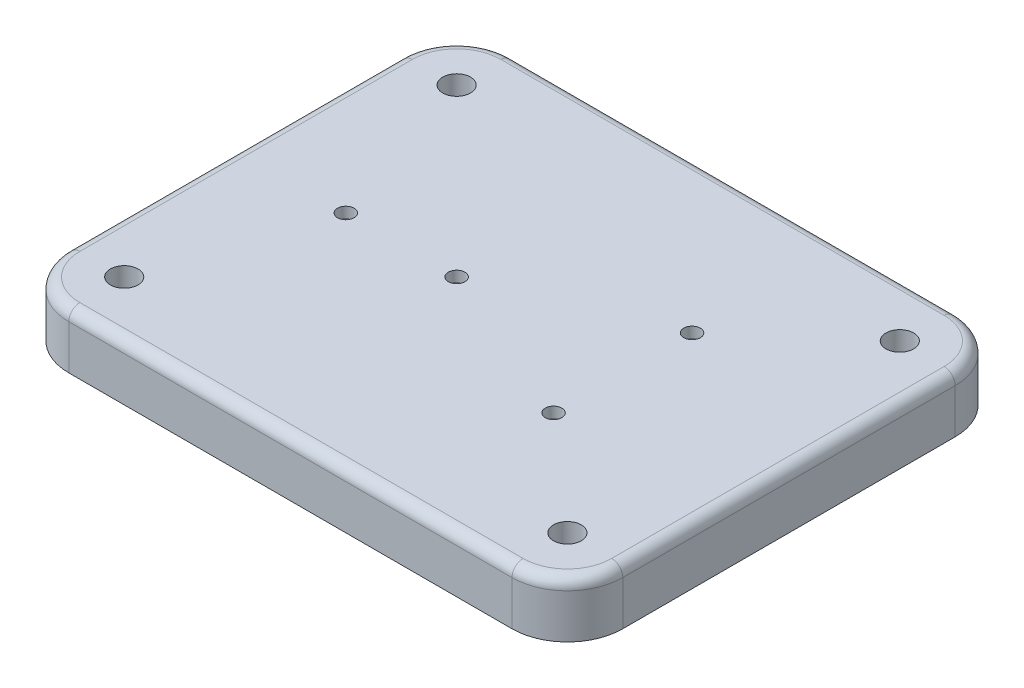
ISO-10303-21;
HEADER;
FILE_DESCRIPTION(('STEP AP214'),'2;1');
FILE_NAME('part.step','',(''),(''),'','','');
FILE_SCHEMA(('AUTOMOTIVE_DESIGN { 1 0 10303 214 1 1 1 1 }'));
ENDSEC;
DATA;
#1=APPLICATION_CONTEXT('core data for automotive mechanical design processes');
#2=APPLICATION_PROTOCOL_DEFINITION('international standard','automotive_design',2000,#1);
#3=PRODUCT_CONTEXT('',#1,'mechanical');
#4=PRODUCT('Part','Part','',(#3));
#5=PRODUCT_RELATED_PRODUCT_CATEGORY('part','',(#4));
#6=PRODUCT_DEFINITION_FORMATION('','',#4);
#7=PRODUCT_DEFINITION_CONTEXT('part definition',#1,'design');
#8=PRODUCT_DEFINITION('design','',#6,#7);
#9=PRODUCT_DEFINITION_SHAPE('','',#8);
#10=(LENGTH_UNIT() NAMED_UNIT(*) SI_UNIT(.MILLI.,.METRE.));
#11=(NAMED_UNIT(*) PLANE_ANGLE_UNIT() SI_UNIT($,.RADIAN.));
#12=(NAMED_UNIT(*) SI_UNIT($,.STERADIAN.) SOLID_ANGLE_UNIT());
#13=UNCERTAINTY_MEASURE_WITH_UNIT(LENGTH_MEASURE(1.E-05),#10,'distance_accuracy_value','');
#14=(GEOMETRIC_REPRESENTATION_CONTEXT(3) GLOBAL_UNCERTAINTY_ASSIGNED_CONTEXT((#13)) GLOBAL_UNIT_ASSIGNED_CONTEXT((#10,
#11,#12)) REPRESENTATION_CONTEXT('',''));
#15=CARTESIAN_POINT('',(0.,0.,0.));
#16=DIRECTION('',(0.,0.,1.));
#17=DIRECTION('',(1.,0.,0.));
#18=AXIS2_PLACEMENT_3D('',#15,#16,#17);
#19=CARTESIAN_POINT('',(0.,0.,0.));
#20=DIRECTION('',(0.,-1.,0.));
#21=DIRECTION('',(0.,0.,-1.));
#22=AXIS2_PLACEMENT_3D('',#19,#20,#21);
#23=PLANE('',#22);
#24=CARTESIAN_POINT('',(-40.,0.,30.));
#25=DIRECTION('',(0.,-1.,0.));
#26=DIRECTION('',(0.,0.,-1.));
#27=AXIS2_PLACEMENT_3D('',#24,#25,#26);
#28=CIRCLE('',#27,4.5);
#29=CARTESIAN_POINT('',(-40.,0.,25.5));
#30=VERTEX_POINT('',#29);
#31=EDGE_CURVE('E239',#30,#30,#28,.F.);
#32=ORIENTED_EDGE('',*,*,#31,.F.);
#33=EDGE_LOOP('',(#32));
#34=FACE_BOUND('',#33,.T.);
#35=CARTESIAN_POINT('',(-40.,0.,30.));
#36=DIRECTION('',(0.,1.,0.));
#37=DIRECTION('',(0.,0.,1.));
#38=AXIS2_PLACEMENT_3D('',#35,#36,#37);
#39=CIRCLE('',#38,2.5);
#40=CARTESIAN_POINT('',(-40.,0.,32.5));
#41=VERTEX_POINT('',#40);
#42=EDGE_CURVE('E326',#41,#41,#39,.T.);
#43=ORIENTED_EDGE('',*,*,#42,.T.);
#44=EDGE_LOOP('',(#43));
#45=FACE_BOUND('',#44,.T.);
#46=ADVANCED_FACE('F39',(#34,#45),#23,.T.);
#47=CARTESIAN_POINT('',(-40.,0.,-30.));
#48=DIRECTION('',(0.,-1.,0.));
#49=DIRECTION('',(0.,0.,-1.));
#50=AXIS2_PLACEMENT_3D('',#47,#48,#49);
#51=CIRCLE('',#50,4.5);
#52=CARTESIAN_POINT('',(-40.,0.,-34.5));
#53=VERTEX_POINT('',#52);
#54=EDGE_CURVE('E244',#53,#53,#51,.F.);
#55=ORIENTED_EDGE('',*,*,#54,.F.);
#56=EDGE_LOOP('',(#55));
#57=FACE_BOUND('',#56,.T.);
#58=CARTESIAN_POINT('',(-40.,0.,-30.));
#59=DIRECTION('',(0.,1.,0.));
#60=DIRECTION('',(0.,0.,1.));
#61=AXIS2_PLACEMENT_3D('',#58,#59,#60);
#62=CIRCLE('',#61,2.5);
#63=CARTESIAN_POINT('',(-40.,0.,-27.5));
#64=VERTEX_POINT('',#63);
#65=EDGE_CURVE('E318',#64,#64,#62,.T.);
#66=ORIENTED_EDGE('',*,*,#65,.T.);
#67=EDGE_LOOP('',(#66));
#68=FACE_BOUND('',#67,.T.);
#69=ADVANCED_FACE('F565',(#57,#68),#23,.T.);
#70=CARTESIAN_POINT('',(40.,0.,-30.));
#71=DIRECTION('',(0.,-1.,0.));
#72=DIRECTION('',(0.,0.,-1.));
#73=AXIS2_PLACEMENT_3D('',#70,#71,#72);
#74=CIRCLE('',#73,4.5);
#75=CARTESIAN_POINT('',(40.,0.,-34.5));
#76=VERTEX_POINT('',#75);
#77=EDGE_CURVE('E249',#76,#76,#74,.F.);
#78=ORIENTED_EDGE('',*,*,#77,.F.);
#79=EDGE_LOOP('',(#78));
#80=FACE_BOUND('',#79,.T.);
#81=CARTESIAN_POINT('',(40.,0.,-30.));
#82=DIRECTION('',(0.,1.,0.));
#83=DIRECTION('',(0.,0.,1.));
#84=AXIS2_PLACEMENT_3D('',#81,#82,#83);
#85=CIRCLE('',#84,2.5);
#86=CARTESIAN_POINT('',(40.,0.,-27.5));
#87=VERTEX_POINT('',#86);
#88=EDGE_CURVE('E309',#87,#87,#85,.T.);
#89=ORIENTED_EDGE('',*,*,#88,.T.);
#90=EDGE_LOOP('',(#89));
#91=FACE_BOUND('',#90,.T.);
#92=ADVANCED_FACE('F571',(#80,#91),#23,.T.);
#93=DIRECTION('',(-1.,0.,0.));
#94=VECTOR('',#93,1.);
#95=CARTESIAN_POINT('',(-50.,0.,-40.));
#96=LINE('',#95,#94);
#97=CARTESIAN_POINT('',(40.,0.,-40.));
#98=VERTEX_POINT('',#97);
#99=CARTESIAN_POINT('',(-40.,0.,-40.));
#100=VERTEX_POINT('',#99);
#101=EDGE_CURVE('E346',#98,#100,#96,.T.);
#102=ORIENTED_EDGE('',*,*,#101,.F.);
#103=CARTESIAN_POINT('',(40.,0.,-30.));
#104=DIRECTION('',(0.,-1.,0.));
#105=DIRECTION('',(0.,0.,-1.));
#106=AXIS2_PLACEMENT_3D('',#103,#104,#105);
#107=CIRCLE('',#106,10.);
#108=CARTESIAN_POINT('',(50.,0.,-30.));
#109=VERTEX_POINT('',#108);
#110=EDGE_CURVE('E390',#98,#109,#107,.T.);
#111=ORIENTED_EDGE('',*,*,#110,.T.);
#112=DIRECTION('',(0.,0.,-1.));
#113=VECTOR('',#112,1.);
#114=CARTESIAN_POINT('',(50.,0.,40.));
#115=LINE('',#114,#113);
#116=CARTESIAN_POINT('',(50.,0.,30.));
#117=VERTEX_POINT('',#116);
#118=EDGE_CURVE('E339',#117,#109,#115,.T.);
#119=ORIENTED_EDGE('',*,*,#118,.F.);
#120=CARTESIAN_POINT('',(40.,0.,30.));
#121=DIRECTION('',(0.,-1.,0.));
#122=DIRECTION('',(0.,0.,-1.));
#123=AXIS2_PLACEMENT_3D('',#120,#121,#122);
#124=CIRCLE('',#123,10.);
#125=CARTESIAN_POINT('',(40.,0.,40.));
#126=VERTEX_POINT('',#125);
#127=EDGE_CURVE('E358',#117,#126,#124,.T.);
#128=ORIENTED_EDGE('',*,*,#127,.T.);
#129=DIRECTION('',(1.,0.,0.));
#130=VECTOR('',#129,1.);
#131=CARTESIAN_POINT('',(-50.,0.,40.));
#132=LINE('',#131,#130);
#133=CARTESIAN_POINT('',(-40.,0.,40.));
#134=VERTEX_POINT('',#133);
#135=EDGE_CURVE('E352',#134,#126,#132,.T.);
#136=ORIENTED_EDGE('',*,*,#135,.F.);
#137=CARTESIAN_POINT('',(-40.,0.,30.));
#138=DIRECTION('',(0.,-1.,0.));
#139=DIRECTION('',(0.,0.,-1.));
#140=AXIS2_PLACEMENT_3D('',#137,#138,#139);
#141=CIRCLE('',#140,10.);
#142=CARTESIAN_POINT('',(-50.,0.,30.));
#143=VERTEX_POINT('',#142);
#144=EDGE_CURVE('E369',#134,#143,#141,.T.);
#145=ORIENTED_EDGE('',*,*,#144,.T.);
#146=DIRECTION('',(0.,0.,1.));
#147=VECTOR('',#146,1.);
#148=CARTESIAN_POINT('',(-50.,0.,40.));
#149=LINE('',#148,#147);
#150=CARTESIAN_POINT('',(-50.,0.,-30.));
#151=VERTEX_POINT('',#150);
#152=EDGE_CURVE('E349',#151,#143,#149,.T.);
#153=ORIENTED_EDGE('',*,*,#152,.F.);
#154=CARTESIAN_POINT('',(-40.,0.,-30.));
#155=DIRECTION('',(0.,-1.,0.));
#156=DIRECTION('',(0.,0.,-1.));
#157=AXIS2_PLACEMENT_3D('',#154,#155,#156);
#158=CIRCLE('',#157,10.);
#159=EDGE_CURVE('E380',#151,#100,#158,.T.);
#160=ORIENTED_EDGE('',*,*,#159,.T.);
#161=EDGE_LOOP('',(#102,#111,#119,#128,#136,#145,#153,#160));
#162=FACE_BOUND('',#161,.T.);
#163=CARTESIAN_POINT('',(40.,0.,-30.));
#164=DIRECTION('',(0.,-1.,0.));
#165=DIRECTION('',(0.,0.,-1.));
#166=AXIS2_PLACEMENT_3D('',#163,#164,#165);
#167=CIRCLE('',#166,8.);
#168=CARTESIAN_POINT('',(40.,0.,-38.));
#169=VERTEX_POINT('',#168);
#170=CARTESIAN_POINT('',(48.,0.,-30.));
#171=VERTEX_POINT('',#170);
#172=EDGE_CURVE('E186',#169,#171,#167,.T.);
#173=ORIENTED_EDGE('',*,*,#172,.F.);
#174=DIRECTION('',(-1.,0.,0.));
#175=VECTOR('',#174,1.);
#176=CARTESIAN_POINT('',(0.,0.,-38.));
#177=LINE('',#176,#175);
#178=CARTESIAN_POINT('',(-40.,0.,-38.));
#179=VERTEX_POINT('',#178);
#180=EDGE_CURVE('E280',#169,#179,#177,.T.);
#181=ORIENTED_EDGE('',*,*,#180,.T.);
#182=CARTESIAN_POINT('',(-40.,0.,-30.));
#183=DIRECTION('',(0.,-1.,0.));
#184=DIRECTION('',(0.,0.,-1.));
#185=AXIS2_PLACEMENT_3D('',#182,#183,#184);
#186=CIRCLE('',#185,8.);
#187=CARTESIAN_POINT('',(-48.,0.,-30.));
#188=VERTEX_POINT('',#187);
#189=EDGE_CURVE('E260',#188,#179,#186,.T.);
#190=ORIENTED_EDGE('',*,*,#189,.F.);
#191=DIRECTION('',(0.,0.,1.));
#192=VECTOR('',#191,1.);
#193=CARTESIAN_POINT('',(-48.,0.,0.));
#194=LINE('',#193,#192);
#195=CARTESIAN_POINT('',(-48.,0.,30.));
#196=VERTEX_POINT('',#195);
#197=EDGE_CURVE('E57',#188,#196,#194,.T.);
#198=ORIENTED_EDGE('',*,*,#197,.T.);
#199=CARTESIAN_POINT('',(-40.,0.,30.));
#200=DIRECTION('',(0.,-1.,0.));
#201=DIRECTION('',(0.,0.,-1.));
#202=AXIS2_PLACEMENT_3D('',#199,#200,#201);
#203=CIRCLE('',#202,8.);
#204=CARTESIAN_POINT('',(-40.,0.,38.));
#205=VERTEX_POINT('',#204);
#206=EDGE_CURVE('E270',#205,#196,#203,.T.);
#207=ORIENTED_EDGE('',*,*,#206,.F.);
#208=DIRECTION('',(1.,0.,0.));
#209=VECTOR('',#208,1.);
#210=CARTESIAN_POINT('',(0.,0.,38.));
#211=LINE('',#210,#209);
#212=CARTESIAN_POINT('',(40.,0.,38.));
#213=VERTEX_POINT('',#212);
#214=EDGE_CURVE('E218',#205,#213,#211,.T.);
#215=ORIENTED_EDGE('',*,*,#214,.T.);
#216=CARTESIAN_POINT('',(40.,0.,30.));
#217=DIRECTION('',(0.,-1.,0.));
#218=DIRECTION('',(0.,0.,-1.));
#219=AXIS2_PLACEMENT_3D('',#216,#217,#218);
#220=CIRCLE('',#219,8.);
#221=CARTESIAN_POINT('',(48.,0.,30.));
#222=VERTEX_POINT('',#221);
#223=EDGE_CURVE('E217',#222,#213,#220,.T.);
#224=ORIENTED_EDGE('',*,*,#223,.F.);
#225=DIRECTION('',(0.,0.,-1.));
#226=VECTOR('',#225,1.);
#227=CARTESIAN_POINT('',(48.,0.,0.));
#228=LINE('',#227,#226);
#229=EDGE_CURVE('E277',#222,#171,#228,.T.);
#230=ORIENTED_EDGE('',*,*,#229,.T.);
#231=EDGE_LOOP('',(#173,#181,#190,#198,#207,#215,#224,#230));
#232=FACE_BOUND('',#231,.T.);
#233=ADVANCED_FACE('F579',(#162,#232),#23,.T.);
#234=CARTESIAN_POINT('',(50.,10.,40.));
#235=DIRECTION('',(-1.,0.,0.));
#236=DIRECTION('',(0.,0.,1.));
#237=AXIS2_PLACEMENT_3D('',#234,#235,#236);
#238=PLANE('',#237);
#239=DIRECTION('',(0.,-1.,0.));
#240=VECTOR('',#239,1.);
#241=CARTESIAN_POINT('',(50.,10.,-30.));
#242=LINE('',#241,#240);
#243=CARTESIAN_POINT('',(50.,8.,-30.));
#244=VERTEX_POINT('',#243);
#245=EDGE_CURVE('E393',#109,#244,#242,.F.);
#246=ORIENTED_EDGE('',*,*,#245,.T.);
#247=DIRECTION('',(0.,0.,-1.));
#248=VECTOR('',#247,1.);
#249=CARTESIAN_POINT('',(50.,8.,40.));
#250=LINE('',#249,#248);
#251=CARTESIAN_POINT('',(50.,8.,30.));
#252=VERTEX_POINT('',#251);
#253=EDGE_CURVE('E426',#244,#252,#250,.F.);
#254=ORIENTED_EDGE('',*,*,#253,.T.);
#255=DIRECTION('',(0.,-1.,0.));
#256=VECTOR('',#255,1.);
#257=CARTESIAN_POINT('',(50.,10.,30.));
#258=LINE('',#257,#256);
#259=EDGE_CURVE('E355',#252,#117,#258,.T.);
#260=ORIENTED_EDGE('',*,*,#259,.T.);
#261=ORIENTED_EDGE('',*,*,#118,.T.);
#262=EDGE_LOOP('',(#246,#254,#260,#261));
#263=FACE_BOUND('',#262,.T.);
#264=ADVANCED_FACE('F589',(#263),#238,.F.);
#265=CARTESIAN_POINT('',(-50.,10.,-40.));
#266=DIRECTION('',(0.,0.,1.));
#267=DIRECTION('',(1.,0.,0.));
#268=AXIS2_PLACEMENT_3D('',#265,#266,#267);
#269=PLANE('',#268);
#270=DIRECTION('',(0.,-1.,0.));
#271=VECTOR('',#270,1.);
#272=CARTESIAN_POINT('',(-40.,10.,-40.));
#273=LINE('',#272,#271);
#274=CARTESIAN_POINT('',(-40.,8.,-40.));
#275=VERTEX_POINT('',#274);
#276=EDGE_CURVE('E384',#100,#275,#273,.F.);
#277=ORIENTED_EDGE('',*,*,#276,.T.);
#278=DIRECTION('',(-1.,0.,0.));
#279=VECTOR('',#278,1.);
#280=CARTESIAN_POINT('',(-50.,8.,-40.));
#281=LINE('',#280,#279);
#282=CARTESIAN_POINT('',(40.,8.,-40.));
#283=VERTEX_POINT('',#282);
#284=EDGE_CURVE('E11',#275,#283,#281,.F.);
#285=ORIENTED_EDGE('',*,*,#284,.T.);
#286=DIRECTION('',(0.,-1.,0.));
#287=VECTOR('',#286,1.);
#288=CARTESIAN_POINT('',(40.,10.,-40.));
#289=LINE('',#288,#287);
#290=EDGE_CURVE('E387',#283,#98,#289,.T.);
#291=ORIENTED_EDGE('',*,*,#290,.T.);
#292=ORIENTED_EDGE('',*,*,#101,.T.);
#293=EDGE_LOOP('',(#277,#285,#291,#292));
#294=FACE_BOUND('',#293,.T.);
#295=ADVANCED_FACE('F595',(#294),#269,.F.);
#296=CARTESIAN_POINT('',(-50.,10.,40.));
#297=DIRECTION('',(1.,0.,0.));
#298=DIRECTION('',(0.,0.,-1.));
#299=AXIS2_PLACEMENT_3D('',#296,#297,#298);
#300=PLANE('',#299);
#301=DIRECTION('',(0.,-1.,0.));
#302=VECTOR('',#301,1.);
#303=CARTESIAN_POINT('',(-50.,10.,30.));
#304=LINE('',#303,#302);
#305=CARTESIAN_POINT('',(-50.,8.,30.));
#306=VERTEX_POINT('',#305);
#307=EDGE_CURVE('E373',#143,#306,#304,.F.);
#308=ORIENTED_EDGE('',*,*,#307,.T.);
#309=DIRECTION('',(0.,0.,1.));
#310=VECTOR('',#309,1.);
#311=CARTESIAN_POINT('',(-50.,8.,40.));
#312=LINE('',#311,#310);
#313=CARTESIAN_POINT('',(-50.,8.,-30.));
#314=VERTEX_POINT('',#313);
#315=EDGE_CURVE('E438',#306,#314,#312,.F.);
#316=ORIENTED_EDGE('',*,*,#315,.T.);
#317=DIRECTION('',(0.,-1.,0.));
#318=VECTOR('',#317,1.);
#319=CARTESIAN_POINT('',(-50.,10.,-30.));
#320=LINE('',#319,#318);
#321=EDGE_CURVE('E377',#314,#151,#320,.T.);
#322=ORIENTED_EDGE('',*,*,#321,.T.);
#323=ORIENTED_EDGE('',*,*,#152,.T.);
#324=EDGE_LOOP('',(#308,#316,#322,#323));
#325=FACE_BOUND('',#324,.T.);
#326=ADVANCED_FACE('F681',(#325),#300,.F.);
#327=CARTESIAN_POINT('',(-50.,10.,40.));
#328=DIRECTION('',(0.,0.,-1.));
#329=DIRECTION('',(-1.,0.,0.));
#330=AXIS2_PLACEMENT_3D('',#327,#328,#329);
#331=PLANE('',#330);
#332=DIRECTION('',(0.,-1.,0.));
#333=VECTOR('',#332,1.);
#334=CARTESIAN_POINT('',(40.,10.,40.));
#335=LINE('',#334,#333);
#336=CARTESIAN_POINT('',(40.,8.,40.));
#337=VERTEX_POINT('',#336);
#338=EDGE_CURVE('E362',#126,#337,#335,.F.);
#339=ORIENTED_EDGE('',*,*,#338,.T.);
#340=DIRECTION('',(1.,0.,0.));
#341=VECTOR('',#340,1.);
#342=CARTESIAN_POINT('',(-50.,8.,40.));
#343=LINE('',#342,#341);
#344=CARTESIAN_POINT('',(-40.,8.,40.));
#345=VERTEX_POINT('',#344);
#346=EDGE_CURVE('E435',#337,#345,#343,.F.);
#347=ORIENTED_EDGE('',*,*,#346,.T.);
#348=DIRECTION('',(0.,-1.,0.));
#349=VECTOR('',#348,1.);
#350=CARTESIAN_POINT('',(-40.,10.,40.));
#351=LINE('',#350,#349);
#352=EDGE_CURVE('E366',#345,#134,#351,.T.);
#353=ORIENTED_EDGE('',*,*,#352,.T.);
#354=ORIENTED_EDGE('',*,*,#135,.T.);
#355=EDGE_LOOP('',(#339,#347,#353,#354));
#356=FACE_BOUND('',#355,.T.);
#357=ADVANCED_FACE('F529',(#356),#331,.F.);
#358=CARTESIAN_POINT('',(0.,10.,0.));
#359=DIRECTION('',(0.,-1.,0.));
#360=DIRECTION('',(0.,0.,-1.));
#361=AXIS2_PLACEMENT_3D('',#358,#359,#360);
#362=PLANE('',#361);
#363=CARTESIAN_POINT('',(-30.,10.,0.));
#364=DIRECTION('',(0.,1.,0.));
#365=DIRECTION('',(0.,0.,1.));
#366=AXIS2_PLACEMENT_3D('',#363,#364,#365);
#367=CIRCLE('',#366,1.5);
#368=CARTESIAN_POINT('',(-30.,10.,1.5));
#369=VERTEX_POINT('',#368);
#370=EDGE_CURVE('E476',#369,#369,#367,.T.);
#371=ORIENTED_EDGE('',*,*,#370,.F.);
#372=EDGE_LOOP('',(#371));
#373=FACE_BOUND('',#372,.T.);
#374=CARTESIAN_POINT('',(-10.,10.,0.));
#375=DIRECTION('',(0.,1.,0.));
#376=DIRECTION('',(0.,0.,1.));
#377=AXIS2_PLACEMENT_3D('',#374,#375,#376);
#378=CIRCLE('',#377,1.5);
#379=CARTESIAN_POINT('',(-10.,10.,1.5));
#380=VERTEX_POINT('',#379);
#381=EDGE_CURVE('E515',#380,#380,#378,.T.);
#382=ORIENTED_EDGE('',*,*,#381,.F.);
#383=EDGE_LOOP('',(#382));
#384=FACE_BOUND('',#383,.T.);
#385=CARTESIAN_POINT('',(20.,10.,-12.5));
#386=DIRECTION('',(0.,1.,0.));
#387=DIRECTION('',(0.,0.,1.));
#388=AXIS2_PLACEMENT_3D('',#385,#386,#387);
#389=CIRCLE('',#388,1.5);
#390=CARTESIAN_POINT('',(20.,10.,-11.));
#391=VERTEX_POINT('',#390);
#392=EDGE_CURVE('E512',#391,#391,#389,.T.);
#393=ORIENTED_EDGE('',*,*,#392,.F.);
#394=EDGE_LOOP('',(#393));
#395=FACE_BOUND('',#394,.T.);
#396=CARTESIAN_POINT('',(20.,10.,12.5));
#397=DIRECTION('',(0.,1.,0.));
#398=DIRECTION('',(0.,0.,1.));
#399=AXIS2_PLACEMENT_3D('',#396,#397,#398);
#400=CIRCLE('',#399,1.5);
#401=CARTESIAN_POINT('',(20.,10.,14.));
#402=VERTEX_POINT('',#401);
#403=EDGE_CURVE('E509',#402,#402,#400,.T.);
#404=ORIENTED_EDGE('',*,*,#403,.F.);
#405=EDGE_LOOP('',(#404));
#406=FACE_BOUND('',#405,.T.);
#407=CARTESIAN_POINT('',(40.,10.,30.));
#408=DIRECTION('',(0.,-1.,0.));
#409=DIRECTION('',(0.,0.,-1.));
#410=AXIS2_PLACEMENT_3D('',#407,#408,#409);
#411=CIRCLE('',#410,8.);
#412=CARTESIAN_POINT('',(40.,10.,38.));
#413=VERTEX_POINT('',#412);
#414=CARTESIAN_POINT('',(48.,10.,30.));
#415=VERTEX_POINT('',#414);
#416=EDGE_CURVE('E416',#413,#415,#411,.F.);
#417=ORIENTED_EDGE('',*,*,#416,.T.);
#418=DIRECTION('',(0.,0.,-1.));
#419=VECTOR('',#418,1.);
#420=CARTESIAN_POINT('',(48.,10.,0.));
#421=LINE('',#420,#419);
#422=CARTESIAN_POINT('',(48.,10.,-30.));
#423=VERTEX_POINT('',#422);
#424=EDGE_CURVE('E419',#415,#423,#421,.T.);
#425=ORIENTED_EDGE('',*,*,#424,.T.);
#426=CARTESIAN_POINT('',(40.,10.,-30.));
#427=DIRECTION('',(0.,-1.,0.));
#428=DIRECTION('',(0.,0.,-1.));
#429=AXIS2_PLACEMENT_3D('',#426,#427,#428);
#430=CIRCLE('',#429,8.);
#431=CARTESIAN_POINT('',(40.,10.,-38.));
#432=VERTEX_POINT('',#431);
#433=EDGE_CURVE('E409',#423,#432,#430,.F.);
#434=ORIENTED_EDGE('',*,*,#433,.T.);
#435=DIRECTION('',(-1.,0.,0.));
#436=VECTOR('',#435,1.);
#437=CARTESIAN_POINT('',(0.,10.,-38.));
#438=LINE('',#437,#436);
#439=CARTESIAN_POINT('',(-40.,10.,-38.));
#440=VERTEX_POINT('',#439);
#441=EDGE_CURVE('E397',#432,#440,#438,.T.);
#442=ORIENTED_EDGE('',*,*,#441,.T.);
#443=CARTESIAN_POINT('',(-40.,10.,-30.));
#444=DIRECTION('',(0.,-1.,0.));
#445=DIRECTION('',(0.,0.,-1.));
#446=AXIS2_PLACEMENT_3D('',#443,#444,#445);
#447=CIRCLE('',#446,8.);
#448=CARTESIAN_POINT('',(-48.,10.,-30.));
#449=VERTEX_POINT('',#448);
#450=EDGE_CURVE('E400',#440,#449,#447,.F.);
#451=ORIENTED_EDGE('',*,*,#450,.T.);
#452=DIRECTION('',(0.,0.,1.));
#453=VECTOR('',#452,1.);
#454=CARTESIAN_POINT('',(-48.,10.,0.));
#455=LINE('',#454,#453);
#456=CARTESIAN_POINT('',(-48.,10.,30.));
#457=VERTEX_POINT('',#456);
#458=EDGE_CURVE('E403',#449,#457,#455,.T.);
#459=ORIENTED_EDGE('',*,*,#458,.T.);
#460=CARTESIAN_POINT('',(-40.,10.,30.));
#461=DIRECTION('',(0.,-1.,0.));
#462=DIRECTION('',(0.,0.,-1.));
#463=AXIS2_PLACEMENT_3D('',#460,#461,#462);
#464=CIRCLE('',#463,8.);
#465=CARTESIAN_POINT('',(-40.,10.,38.));
#466=VERTEX_POINT('',#465);
#467=EDGE_CURVE('E406',#457,#466,#464,.F.);
#468=ORIENTED_EDGE('',*,*,#467,.T.);
#469=DIRECTION('',(1.,0.,0.));
#470=VECTOR('',#469,1.);
#471=CARTESIAN_POINT('',(0.,10.,38.));
#472=LINE('',#471,#470);
#473=EDGE_CURVE('E413',#466,#413,#472,.T.);
#474=ORIENTED_EDGE('',*,*,#473,.T.);
#475=EDGE_LOOP('',(#417,#425,#434,#442,#451,#459,#468,#474));
#476=FACE_BOUND('',#475,.T.);
#477=CARTESIAN_POINT('',(-40.,10.,30.));
#478=DIRECTION('',(0.,1.,0.));
#479=DIRECTION('',(0.,0.,1.));
#480=AXIS2_PLACEMENT_3D('',#477,#478,#479);
#481=CIRCLE('',#480,2.5);
#482=CARTESIAN_POINT('',(-40.,10.,32.5));
#483=VERTEX_POINT('',#482);
#484=EDGE_CURVE('E330',#483,#483,#481,.T.);
#485=ORIENTED_EDGE('',*,*,#484,.F.);
#486=EDGE_LOOP('',(#485));
#487=FACE_BOUND('',#486,.T.);
#488=CARTESIAN_POINT('',(-40.,10.,-30.));
#489=DIRECTION('',(0.,1.,0.));
#490=DIRECTION('',(0.,0.,1.));
#491=AXIS2_PLACEMENT_3D('',#488,#489,#490);
#492=CIRCLE('',#491,2.5);
#493=CARTESIAN_POINT('',(-40.,10.,-27.5));
#494=VERTEX_POINT('',#493);
#495=EDGE_CURVE('E322',#494,#494,#492,.T.);
#496=ORIENTED_EDGE('',*,*,#495,.F.);
#497=EDGE_LOOP('',(#496));
#498=FACE_BOUND('',#497,.T.);
#499=CARTESIAN_POINT('',(40.,10.,-30.));
#500=DIRECTION('',(0.,1.,0.));
#501=DIRECTION('',(0.,0.,1.));
#502=AXIS2_PLACEMENT_3D('',#499,#500,#501);
#503=CIRCLE('',#502,2.5);
#504=CARTESIAN_POINT('',(40.,10.,-27.5));
#505=VERTEX_POINT('',#504);
#506=EDGE_CURVE('E314',#505,#505,#503,.T.);
#507=ORIENTED_EDGE('',*,*,#506,.F.);
#508=EDGE_LOOP('',(#507));
#509=FACE_BOUND('',#508,.T.);
#510=CARTESIAN_POINT('',(40.,10.,30.));
#511=DIRECTION('',(0.,1.,0.));
#512=DIRECTION('',(0.,0.,1.));
#513=AXIS2_PLACEMENT_3D('',#510,#511,#512);
#514=CIRCLE('',#513,2.5);
#515=CARTESIAN_POINT('',(40.,10.,32.5));
#516=VERTEX_POINT('',#515);
#517=EDGE_CURVE('E313',#516,#516,#514,.T.);
#518=ORIENTED_EDGE('',*,*,#517,.F.);
#519=EDGE_LOOP('',(#518));
#520=FACE_BOUND('',#519,.T.);
#521=ADVANCED_FACE('F525',(#373,#384,#395,#406,#476,#487,#498,#509,#520),#362,.F.);
#522=CARTESIAN_POINT('',(40.,0.,30.));
#523=DIRECTION('',(0.,-1.,0.));
#524=DIRECTION('',(0.,0.,-1.));
#525=AXIS2_PLACEMENT_3D('',#522,#523,#524);
#526=CIRCLE('',#525,4.5);
#527=CARTESIAN_POINT('',(40.,0.,25.5));
#528=VERTEX_POINT('',#527);
#529=EDGE_CURVE('E254',#528,#528,#526,.F.);
#530=ORIENTED_EDGE('',*,*,#529,.F.);
#531=EDGE_LOOP('',(#530));
#532=FACE_BOUND('',#531,.T.);
#533=CARTESIAN_POINT('',(40.,0.,30.));
#534=DIRECTION('',(0.,1.,0.));
#535=DIRECTION('',(0.,0.,1.));
#536=AXIS2_PLACEMENT_3D('',#533,#534,#535);
#537=CIRCLE('',#536,2.5);
#538=CARTESIAN_POINT('',(40.,0.,32.5));
#539=VERTEX_POINT('',#538);
#540=EDGE_CURVE('E335',#539,#539,#537,.T.);
#541=ORIENTED_EDGE('',*,*,#540,.T.);
#542=EDGE_LOOP('',(#541));
#543=FACE_BOUND('',#542,.T.);
#544=ADVANCED_FACE('F528',(#532,#543),#23,.T.);
#545=CARTESIAN_POINT('',(40.,10.,30.));
#546=DIRECTION('',(0.,-1.,0.));
#547=DIRECTION('',(0.,0.,-1.));
#548=AXIS2_PLACEMENT_3D('',#545,#546,#547);
#549=CYLINDRICAL_SURFACE('',#548,10.);
#550=ORIENTED_EDGE('',*,*,#259,.F.);
#551=CARTESIAN_POINT('',(40.,8.,30.));
#552=DIRECTION('',(0.,-1.,0.));
#553=DIRECTION('',(0.,0.,-1.));
#554=AXIS2_PLACEMENT_3D('',#551,#552,#553);
#555=CIRCLE('',#554,10.);
#556=EDGE_CURVE('E429',#252,#337,#555,.T.);
#557=ORIENTED_EDGE('',*,*,#556,.T.);
#558=ORIENTED_EDGE('',*,*,#338,.F.);
#559=ORIENTED_EDGE('',*,*,#127,.F.);
#560=EDGE_LOOP('',(#550,#557,#558,#559));
#561=FACE_BOUND('',#560,.T.);
#562=ADVANCED_FACE('F577',(#561),#549,.T.);
#563=CARTESIAN_POINT('',(-40.,10.,30.));
#564=DIRECTION('',(0.,-1.,0.));
#565=DIRECTION('',(0.,0.,-1.));
#566=AXIS2_PLACEMENT_3D('',#563,#564,#565);
#567=CYLINDRICAL_SURFACE('',#566,10.);
#568=ORIENTED_EDGE('',*,*,#352,.F.);
#569=CARTESIAN_POINT('',(-40.,8.,30.));
#570=DIRECTION('',(0.,-1.,0.));
#571=DIRECTION('',(0.,0.,-1.));
#572=AXIS2_PLACEMENT_3D('',#569,#570,#571);
#573=CIRCLE('',#572,10.);
#574=EDGE_CURVE('E432',#345,#306,#573,.T.);
#575=ORIENTED_EDGE('',*,*,#574,.T.);
#576=ORIENTED_EDGE('',*,*,#307,.F.);
#577=ORIENTED_EDGE('',*,*,#144,.F.);
#578=EDGE_LOOP('',(#568,#575,#576,#577));
#579=FACE_BOUND('',#578,.T.);
#580=ADVANCED_FACE('F583',(#579),#567,.T.);
#581=CARTESIAN_POINT('',(-40.,10.,-30.));
#582=DIRECTION('',(0.,-1.,0.));
#583=DIRECTION('',(0.,0.,-1.));
#584=AXIS2_PLACEMENT_3D('',#581,#582,#583);
#585=CYLINDRICAL_SURFACE('',#584,10.);
#586=ORIENTED_EDGE('',*,*,#321,.F.);
#587=CARTESIAN_POINT('',(-40.,8.,-30.));
#588=DIRECTION('',(0.,-1.,0.));
#589=DIRECTION('',(0.,0.,-1.));
#590=AXIS2_PLACEMENT_3D('',#587,#588,#589);
#591=CIRCLE('',#590,10.);
#592=EDGE_CURVE('E49',#314,#275,#591,.T.);
#593=ORIENTED_EDGE('',*,*,#592,.T.);
#594=ORIENTED_EDGE('',*,*,#276,.F.);
#595=ORIENTED_EDGE('',*,*,#159,.F.);
#596=EDGE_LOOP('',(#586,#593,#594,#595));
#597=FACE_BOUND('',#596,.T.);
#598=ADVANCED_FACE('F559',(#597),#585,.T.);
#599=CARTESIAN_POINT('',(40.,10.,-30.));
#600=DIRECTION('',(0.,-1.,0.));
#601=DIRECTION('',(0.,0.,-1.));
#602=AXIS2_PLACEMENT_3D('',#599,#600,#601);
#603=CYLINDRICAL_SURFACE('',#602,10.);
#604=ORIENTED_EDGE('',*,*,#290,.F.);
#605=CARTESIAN_POINT('',(40.,8.,-30.));
#606=DIRECTION('',(0.,-1.,0.));
#607=DIRECTION('',(0.,0.,-1.));
#608=AXIS2_PLACEMENT_3D('',#605,#606,#607);
#609=CIRCLE('',#608,10.);
#610=EDGE_CURVE('E422',#283,#244,#609,.T.);
#611=ORIENTED_EDGE('',*,*,#610,.T.);
#612=ORIENTED_EDGE('',*,*,#245,.F.);
#613=ORIENTED_EDGE('',*,*,#110,.F.);
#614=EDGE_LOOP('',(#604,#611,#612,#613));
#615=FACE_BOUND('',#614,.T.);
#616=ADVANCED_FACE('F549',(#615),#603,.T.);
#617=CARTESIAN_POINT('',(40.,0.,30.));
#618=DIRECTION('',(0.,1.,0.));
#619=DIRECTION('',(0.,0.,1.));
#620=AXIS2_PLACEMENT_3D('',#617,#618,#619);
#621=CYLINDRICAL_SURFACE('',#620,2.5);
#622=ORIENTED_EDGE('',*,*,#540,.F.);
#623=EDGE_LOOP('',(#622));
#624=FACE_BOUND('',#623,.T.);
#625=ORIENTED_EDGE('',*,*,#517,.T.);
#626=EDGE_LOOP('',(#625));
#627=FACE_BOUND('',#626,.T.);
#628=ADVANCED_FACE('F546',(#624,#627),#621,.F.);
#629=CARTESIAN_POINT('',(40.,0.,-30.));
#630=DIRECTION('',(0.,1.,0.));
#631=DIRECTION('',(0.,0.,1.));
#632=AXIS2_PLACEMENT_3D('',#629,#630,#631);
#633=CYLINDRICAL_SURFACE('',#632,2.5);
#634=ORIENTED_EDGE('',*,*,#88,.F.);
#635=EDGE_LOOP('',(#634));
#636=FACE_BOUND('',#635,.T.);
#637=ORIENTED_EDGE('',*,*,#506,.T.);
#638=EDGE_LOOP('',(#637));
#639=FACE_BOUND('',#638,.T.);
#640=ADVANCED_FACE('F548',(#636,#639),#633,.F.);
#641=CARTESIAN_POINT('',(-40.,0.,-30.));
#642=DIRECTION('',(0.,1.,0.));
#643=DIRECTION('',(0.,0.,1.));
#644=AXIS2_PLACEMENT_3D('',#641,#642,#643);
#645=CYLINDRICAL_SURFACE('',#644,2.5);
#646=ORIENTED_EDGE('',*,*,#65,.F.);
#647=EDGE_LOOP('',(#646));
#648=FACE_BOUND('',#647,.T.);
#649=ORIENTED_EDGE('',*,*,#495,.T.);
#650=EDGE_LOOP('',(#649));
#651=FACE_BOUND('',#650,.T.);
#652=ADVANCED_FACE('F556',(#648,#651),#645,.F.);
#653=CARTESIAN_POINT('',(-40.,0.,30.));
#654=DIRECTION('',(0.,1.,0.));
#655=DIRECTION('',(0.,0.,1.));
#656=AXIS2_PLACEMENT_3D('',#653,#654,#655);
#657=CYLINDRICAL_SURFACE('',#656,2.5);
#658=ORIENTED_EDGE('',*,*,#42,.F.);
#659=EDGE_LOOP('',(#658));
#660=FACE_BOUND('',#659,.T.);
#661=ORIENTED_EDGE('',*,*,#484,.T.);
#662=EDGE_LOOP('',(#661));
#663=FACE_BOUND('',#662,.T.);
#664=ADVANCED_FACE('F656',(#660,#663),#657,.F.);
#665=CARTESIAN_POINT('',(-40.,8.,30.));
#666=DIRECTION('',(0.,-1.,0.));
#667=DIRECTION('',(0.,0.,-1.));
#668=AXIS2_PLACEMENT_3D('',#665,#666,#667);
#669=TOROIDAL_SURFACE('',#668,8.,2.);
#670=CARTESIAN_POINT('',(-48.,8.,30.));
#671=DIRECTION('',(0.,0.,-1.));
#672=DIRECTION('',(-1.,0.,0.));
#673=AXIS2_PLACEMENT_3D('',#670,#671,#672);
#674=CIRCLE('',#673,2.);
#675=EDGE_CURVE('E464',#306,#457,#674,.T.);
#676=ORIENTED_EDGE('',*,*,#675,.F.);
#677=ORIENTED_EDGE('',*,*,#574,.F.);
#678=CARTESIAN_POINT('',(-40.,8.,38.));
#679=DIRECTION('',(1.,0.,0.));
#680=DIRECTION('',(0.,0.,-1.));
#681=AXIS2_PLACEMENT_3D('',#678,#679,#680);
#682=CIRCLE('',#681,2.);
#683=EDGE_CURVE('E334',#466,#345,#682,.T.);
#684=ORIENTED_EDGE('',*,*,#683,.F.);
#685=ORIENTED_EDGE('',*,*,#467,.F.);
#686=EDGE_LOOP('',(#676,#677,#684,#685));
#687=FACE_BOUND('',#686,.T.);
#688=ADVANCED_FACE('F41',(#687),#669,.T.);
#689=CARTESIAN_POINT('',(0.,8.,38.));
#690=DIRECTION('',(1.,0.,0.));
#691=DIRECTION('',(0.,0.,-1.));
#692=AXIS2_PLACEMENT_3D('',#689,#690,#691);
#693=CYLINDRICAL_SURFACE('',#692,2.);
#694=ORIENTED_EDGE('',*,*,#683,.T.);
#695=ORIENTED_EDGE('',*,*,#346,.F.);
#696=CARTESIAN_POINT('',(40.,8.,38.));
#697=DIRECTION('',(1.,0.,0.));
#698=DIRECTION('',(0.,0.,-1.));
#699=AXIS2_PLACEMENT_3D('',#696,#697,#698);
#700=CIRCLE('',#699,2.);
#701=EDGE_CURVE('E460',#413,#337,#700,.T.);
#702=ORIENTED_EDGE('',*,*,#701,.F.);
#703=ORIENTED_EDGE('',*,*,#473,.F.);
#704=EDGE_LOOP('',(#694,#695,#702,#703));
#705=FACE_BOUND('',#704,.T.);
#706=ADVANCED_FACE('F663',(#705),#693,.T.);
#707=CARTESIAN_POINT('',(-48.,8.,0.));
#708=DIRECTION('',(0.,0.,1.));
#709=DIRECTION('',(1.,0.,0.));
#710=AXIS2_PLACEMENT_3D('',#707,#708,#709);
#711=CYLINDRICAL_SURFACE('',#710,2.);
#712=ORIENTED_EDGE('',*,*,#675,.T.);
#713=ORIENTED_EDGE('',*,*,#458,.F.);
#714=CARTESIAN_POINT('',(-48.,8.,-30.));
#715=DIRECTION('',(0.,0.,-1.));
#716=DIRECTION('',(-1.,0.,0.));
#717=AXIS2_PLACEMENT_3D('',#714,#715,#716);
#718=CIRCLE('',#717,2.);
#719=EDGE_CURVE('E456',#314,#449,#718,.T.);
#720=ORIENTED_EDGE('',*,*,#719,.F.);
#721=ORIENTED_EDGE('',*,*,#315,.F.);
#722=EDGE_LOOP('',(#712,#713,#720,#721));
#723=FACE_BOUND('',#722,.T.);
#724=ADVANCED_FACE('F670',(#723),#711,.T.);
#725=CARTESIAN_POINT('',(40.,8.,30.));
#726=DIRECTION('',(0.,-1.,0.));
#727=DIRECTION('',(0.,0.,-1.));
#728=AXIS2_PLACEMENT_3D('',#725,#726,#727);
#729=TOROIDAL_SURFACE('',#728,8.,2.);
#730=ORIENTED_EDGE('',*,*,#701,.T.);
#731=ORIENTED_EDGE('',*,*,#556,.F.);
#732=CARTESIAN_POINT('',(48.,8.,30.));
#733=DIRECTION('',(0.,0.,-1.));
#734=DIRECTION('',(-1.,0.,0.));
#735=AXIS2_PLACEMENT_3D('',#732,#733,#734);
#736=CIRCLE('',#735,2.);
#737=EDGE_CURVE('E452',#415,#252,#736,.T.);
#738=ORIENTED_EDGE('',*,*,#737,.F.);
#739=ORIENTED_EDGE('',*,*,#416,.F.);
#740=EDGE_LOOP('',(#730,#731,#738,#739));
#741=FACE_BOUND('',#740,.T.);
#742=ADVANCED_FACE('F696',(#741),#729,.T.);
#743=CARTESIAN_POINT('',(-40.,8.,-30.));
#744=DIRECTION('',(0.,-1.,0.));
#745=DIRECTION('',(0.,0.,-1.));
#746=AXIS2_PLACEMENT_3D('',#743,#744,#745);
#747=TOROIDAL_SURFACE('',#746,8.,2.);
#748=ORIENTED_EDGE('',*,*,#719,.T.);
#749=ORIENTED_EDGE('',*,*,#450,.F.);
#750=CARTESIAN_POINT('',(-40.,8.,-38.));
#751=DIRECTION('',(1.,0.,0.));
#752=DIRECTION('',(0.,0.,-1.));
#753=AXIS2_PLACEMENT_3D('',#750,#751,#752);
#754=CIRCLE('',#753,2.);
#755=EDGE_CURVE('E448',#275,#440,#754,.T.);
#756=ORIENTED_EDGE('',*,*,#755,.F.);
#757=ORIENTED_EDGE('',*,*,#592,.F.);
#758=EDGE_LOOP('',(#748,#749,#756,#757));
#759=FACE_BOUND('',#758,.T.);
#760=ADVANCED_FACE('F713',(#759),#747,.T.);
#761=CARTESIAN_POINT('',(48.,8.,0.));
#762=DIRECTION('',(0.,0.,-1.));
#763=DIRECTION('',(-1.,0.,0.));
#764=AXIS2_PLACEMENT_3D('',#761,#762,#763);
#765=CYLINDRICAL_SURFACE('',#764,2.);
#766=ORIENTED_EDGE('',*,*,#737,.T.);
#767=ORIENTED_EDGE('',*,*,#253,.F.);
#768=CARTESIAN_POINT('',(48.,8.,-30.));
#769=DIRECTION('',(0.,0.,-1.));
#770=DIRECTION('',(-1.,0.,0.));
#771=AXIS2_PLACEMENT_3D('',#768,#769,#770);
#772=CIRCLE('',#771,2.);
#773=EDGE_CURVE('E445',#423,#244,#772,.T.);
#774=ORIENTED_EDGE('',*,*,#773,.F.);
#775=ORIENTED_EDGE('',*,*,#424,.F.);
#776=EDGE_LOOP('',(#766,#767,#774,#775));
#777=FACE_BOUND('',#776,.T.);
#778=ADVANCED_FACE('F701',(#777),#765,.T.);
#779=CARTESIAN_POINT('',(0.,8.,-38.));
#780=DIRECTION('',(-1.,0.,0.));
#781=DIRECTION('',(0.,0.,1.));
#782=AXIS2_PLACEMENT_3D('',#779,#780,#781);
#783=CYLINDRICAL_SURFACE('',#782,2.);
#784=ORIENTED_EDGE('',*,*,#755,.T.);
#785=ORIENTED_EDGE('',*,*,#441,.F.);
#786=CARTESIAN_POINT('',(40.,8.,-38.));
#787=DIRECTION('',(1.,0.,0.));
#788=DIRECTION('',(0.,0.,-1.));
#789=AXIS2_PLACEMENT_3D('',#786,#787,#788);
#790=CIRCLE('',#789,2.);
#791=EDGE_CURVE('E234',#283,#432,#790,.T.);
#792=ORIENTED_EDGE('',*,*,#791,.F.);
#793=ORIENTED_EDGE('',*,*,#284,.F.);
#794=EDGE_LOOP('',(#784,#785,#792,#793));
#795=FACE_BOUND('',#794,.T.);
#796=ADVANCED_FACE('F710',(#795),#783,.T.);
#797=CARTESIAN_POINT('',(40.,8.,-30.));
#798=DIRECTION('',(0.,-1.,0.));
#799=DIRECTION('',(0.,0.,-1.));
#800=AXIS2_PLACEMENT_3D('',#797,#798,#799);
#801=TOROIDAL_SURFACE('',#800,8.,2.);
#802=ORIENTED_EDGE('',*,*,#773,.T.);
#803=ORIENTED_EDGE('',*,*,#610,.F.);
#804=ORIENTED_EDGE('',*,*,#791,.T.);
#805=ORIENTED_EDGE('',*,*,#433,.F.);
#806=EDGE_LOOP('',(#802,#803,#804,#805));
#807=FACE_BOUND('',#806,.T.);
#808=ADVANCED_FACE('F627',(#807),#801,.T.);
#809=CARTESIAN_POINT('',(48.,10.,40.));
#810=DIRECTION('',(-1.,0.,0.));
#811=DIRECTION('',(0.,0.,1.));
#812=AXIS2_PLACEMENT_3D('',#809,#810,#811);
#813=PLANE('',#812);
#814=DIRECTION('',(0.,1.,0.));
#815=VECTOR('',#814,1.);
#816=CARTESIAN_POINT('',(48.,10.,-30.));
#817=LINE('',#816,#815);
#818=CARTESIAN_POINT('',(48.,8.,-30.));
#819=VERTEX_POINT('',#818);
#820=EDGE_CURVE('E180',#171,#819,#817,.T.);
#821=ORIENTED_EDGE('',*,*,#820,.F.);
#822=ORIENTED_EDGE('',*,*,#229,.F.);
#823=DIRECTION('',(0.,1.,0.));
#824=VECTOR('',#823,1.);
#825=CARTESIAN_POINT('',(48.,10.,30.));
#826=LINE('',#825,#824);
#827=CARTESIAN_POINT('',(48.,8.,30.));
#828=VERTEX_POINT('',#827);
#829=EDGE_CURVE('E207',#828,#222,#826,.F.);
#830=ORIENTED_EDGE('',*,*,#829,.F.);
#831=DIRECTION('',(0.,0.,1.));
#832=VECTOR('',#831,1.);
#833=CARTESIAN_POINT('',(48.,8.,40.));
#834=LINE('',#833,#832);
#835=EDGE_CURVE('E199',#819,#828,#834,.T.);
#836=ORIENTED_EDGE('',*,*,#835,.F.);
#837=EDGE_LOOP('',(#821,#822,#830,#836));
#838=FACE_BOUND('',#837,.T.);
#839=ADVANCED_FACE('F206',(#838),#813,.T.);
#840=CARTESIAN_POINT('',(-50.,10.,-38.));
#841=DIRECTION('',(0.,0.,1.));
#842=DIRECTION('',(1.,0.,0.));
#843=AXIS2_PLACEMENT_3D('',#840,#841,#842);
#844=PLANE('',#843);
#845=DIRECTION('',(0.,1.,0.));
#846=VECTOR('',#845,1.);
#847=CARTESIAN_POINT('',(-40.,10.,-38.));
#848=LINE('',#847,#846);
#849=CARTESIAN_POINT('',(-40.,8.,-38.));
#850=VERTEX_POINT('',#849);
#851=EDGE_CURVE('E255',#179,#850,#848,.T.);
#852=ORIENTED_EDGE('',*,*,#851,.F.);
#853=ORIENTED_EDGE('',*,*,#180,.F.);
#854=DIRECTION('',(0.,1.,0.));
#855=VECTOR('',#854,1.);
#856=CARTESIAN_POINT('',(40.,10.,-38.));
#857=LINE('',#856,#855);
#858=CARTESIAN_POINT('',(40.,8.,-38.));
#859=VERTEX_POINT('',#858);
#860=EDGE_CURVE('E259',#859,#169,#857,.F.);
#861=ORIENTED_EDGE('',*,*,#860,.F.);
#862=DIRECTION('',(-1.,0.,0.));
#863=VECTOR('',#862,1.);
#864=CARTESIAN_POINT('',(0.,8.,-38.));
#865=LINE('',#864,#863);
#866=EDGE_CURVE('E192',#859,#850,#865,.T.);
#867=ORIENTED_EDGE('',*,*,#866,.T.);
#868=EDGE_LOOP('',(#852,#853,#861,#867));
#869=FACE_BOUND('',#868,.T.);
#870=ADVANCED_FACE('F619',(#869),#844,.T.);
#871=CARTESIAN_POINT('',(-48.,10.,40.));
#872=DIRECTION('',(1.,0.,0.));
#873=DIRECTION('',(0.,0.,-1.));
#874=AXIS2_PLACEMENT_3D('',#871,#872,#873);
#875=PLANE('',#874);
#876=DIRECTION('',(0.,1.,0.));
#877=VECTOR('',#876,1.);
#878=CARTESIAN_POINT('',(-48.,10.,30.));
#879=LINE('',#878,#877);
#880=CARTESIAN_POINT('',(-48.,8.,30.));
#881=VERTEX_POINT('',#880);
#882=EDGE_CURVE('E266',#196,#881,#879,.T.);
#883=ORIENTED_EDGE('',*,*,#882,.F.);
#884=ORIENTED_EDGE('',*,*,#197,.F.);
#885=DIRECTION('',(0.,1.,0.));
#886=VECTOR('',#885,1.);
#887=CARTESIAN_POINT('',(-48.,10.,-30.));
#888=LINE('',#887,#886);
#889=CARTESIAN_POINT('',(-48.,8.,-30.));
#890=VERTEX_POINT('',#889);
#891=EDGE_CURVE('E263',#890,#188,#888,.F.);
#892=ORIENTED_EDGE('',*,*,#891,.F.);
#893=DIRECTION('',(0.,0.,1.));
#894=VECTOR('',#893,1.);
#895=CARTESIAN_POINT('',(-48.,8.,0.));
#896=LINE('',#895,#894);
#897=EDGE_CURVE('E204',#890,#881,#896,.T.);
#898=ORIENTED_EDGE('',*,*,#897,.T.);
#899=EDGE_LOOP('',(#883,#884,#892,#898));
#900=FACE_BOUND('',#899,.T.);
#901=ADVANCED_FACE('F614',(#900),#875,.T.);
#902=CARTESIAN_POINT('',(-50.,10.,38.));
#903=DIRECTION('',(0.,0.,-1.));
#904=DIRECTION('',(-1.,0.,0.));
#905=AXIS2_PLACEMENT_3D('',#902,#903,#904);
#906=PLANE('',#905);
#907=DIRECTION('',(0.,1.,0.));
#908=VECTOR('',#907,1.);
#909=CARTESIAN_POINT('',(40.,10.,38.));
#910=LINE('',#909,#908);
#911=CARTESIAN_POINT('',(40.,8.,38.));
#912=VERTEX_POINT('',#911);
#913=EDGE_CURVE('E274',#213,#912,#910,.T.);
#914=ORIENTED_EDGE('',*,*,#913,.F.);
#915=ORIENTED_EDGE('',*,*,#214,.F.);
#916=DIRECTION('',(0.,1.,0.));
#917=VECTOR('',#916,1.);
#918=CARTESIAN_POINT('',(-40.,10.,38.));
#919=LINE('',#918,#917);
#920=CARTESIAN_POINT('',(-40.,8.,38.));
#921=VERTEX_POINT('',#920);
#922=EDGE_CURVE('E271',#921,#205,#919,.F.);
#923=ORIENTED_EDGE('',*,*,#922,.F.);
#924=DIRECTION('',(-1.,0.,0.));
#925=VECTOR('',#924,1.);
#926=CARTESIAN_POINT('',(-50.,8.,38.));
#927=LINE('',#926,#925);
#928=EDGE_CURVE('E230',#912,#921,#927,.T.);
#929=ORIENTED_EDGE('',*,*,#928,.F.);
#930=EDGE_LOOP('',(#914,#915,#923,#929));
#931=FACE_BOUND('',#930,.T.);
#932=ADVANCED_FACE('F494',(#931),#906,.T.);
#933=CARTESIAN_POINT('',(0.,8.,0.));
#934=DIRECTION('',(0.,-1.,0.));
#935=DIRECTION('',(0.,0.,-1.));
#936=AXIS2_PLACEMENT_3D('',#933,#934,#935);
#937=PLANE('',#936);
#938=CARTESIAN_POINT('',(-30.,8.,0.));
#939=DIRECTION('',(0.,-1.,0.));
#940=DIRECTION('',(0.,0.,-1.));
#941=AXIS2_PLACEMENT_3D('',#938,#939,#940);
#942=CIRCLE('',#941,1.5);
#943=CARTESIAN_POINT('',(-30.,8.,-1.5));
#944=VERTEX_POINT('',#943);
#945=EDGE_CURVE('E43',#944,#944,#942,.T.);
#946=ORIENTED_EDGE('',*,*,#945,.F.);
#947=EDGE_LOOP('',(#946));
#948=FACE_BOUND('',#947,.T.);
#949=CARTESIAN_POINT('',(-10.,8.,0.));
#950=DIRECTION('',(0.,-1.,0.));
#951=DIRECTION('',(0.,0.,-1.));
#952=AXIS2_PLACEMENT_3D('',#949,#950,#951);
#953=CIRCLE('',#952,1.5);
#954=CARTESIAN_POINT('',(-10.,8.,-1.5));
#955=VERTEX_POINT('',#954);
#956=EDGE_CURVE('E479',#955,#955,#953,.T.);
#957=ORIENTED_EDGE('',*,*,#956,.F.);
#958=EDGE_LOOP('',(#957));
#959=FACE_BOUND('',#958,.T.);
#960=CARTESIAN_POINT('',(20.,8.,-12.5));
#961=DIRECTION('',(0.,-1.,0.));
#962=DIRECTION('',(0.,0.,-1.));
#963=AXIS2_PLACEMENT_3D('',#960,#961,#962);
#964=CIRCLE('',#963,1.5);
#965=CARTESIAN_POINT('',(20.,8.,-14.));
#966=VERTEX_POINT('',#965);
#967=EDGE_CURVE('E475',#966,#966,#964,.T.);
#968=ORIENTED_EDGE('',*,*,#967,.F.);
#969=EDGE_LOOP('',(#968));
#970=FACE_BOUND('',#969,.T.);
#971=CARTESIAN_POINT('',(20.,8.,12.5));
#972=DIRECTION('',(0.,-1.,0.));
#973=DIRECTION('',(0.,0.,-1.));
#974=AXIS2_PLACEMENT_3D('',#971,#972,#973);
#975=CIRCLE('',#974,1.5);
#976=CARTESIAN_POINT('',(20.,8.,11.));
#977=VERTEX_POINT('',#976);
#978=EDGE_CURVE('E471',#977,#977,#975,.T.);
#979=ORIENTED_EDGE('',*,*,#978,.F.);
#980=EDGE_LOOP('',(#979));
#981=FACE_BOUND('',#980,.T.);
#982=CARTESIAN_POINT('',(40.,8.,30.));
#983=DIRECTION('',(0.,-1.,0.));
#984=DIRECTION('',(0.,0.,-1.));
#985=AXIS2_PLACEMENT_3D('',#982,#983,#984);
#986=CIRCLE('',#985,8.);
#987=EDGE_CURVE('E209',#828,#912,#986,.T.);
#988=ORIENTED_EDGE('',*,*,#987,.T.);
#989=ORIENTED_EDGE('',*,*,#928,.T.);
#990=CARTESIAN_POINT('',(-40.,8.,30.));
#991=DIRECTION('',(0.,-1.,0.));
#992=DIRECTION('',(0.,0.,-1.));
#993=AXIS2_PLACEMENT_3D('',#990,#991,#992);
#994=CIRCLE('',#993,8.);
#995=EDGE_CURVE('E212',#921,#881,#994,.T.);
#996=ORIENTED_EDGE('',*,*,#995,.T.);
#997=ORIENTED_EDGE('',*,*,#897,.F.);
#998=CARTESIAN_POINT('',(-40.,8.,-30.));
#999=DIRECTION('',(0.,-1.,0.));
#1000=DIRECTION('',(0.,0.,-1.));
#1001=AXIS2_PLACEMENT_3D('',#998,#999,#1000);
#1002=CIRCLE('',#1001,8.);
#1003=EDGE_CURVE('E222',#850,#890,#1002,.F.);
#1004=ORIENTED_EDGE('',*,*,#1003,.F.);
#1005=ORIENTED_EDGE('',*,*,#866,.F.);
#1006=CARTESIAN_POINT('',(40.,8.,-30.));
#1007=DIRECTION('',(0.,-1.,0.));
#1008=DIRECTION('',(0.,0.,-1.));
#1009=AXIS2_PLACEMENT_3D('',#1006,#1007,#1008);
#1010=CIRCLE('',#1009,8.);
#1011=EDGE_CURVE('E183',#859,#819,#1010,.T.);
#1012=ORIENTED_EDGE('',*,*,#1011,.T.);
#1013=ORIENTED_EDGE('',*,*,#835,.T.);
#1014=EDGE_LOOP('',(#988,#989,#996,#997,#1004,#1005,#1012,#1013));
#1015=FACE_BOUND('',#1014,.T.);
#1016=CARTESIAN_POINT('',(-40.,8.,30.));
#1017=DIRECTION('',(0.,-1.,0.));
#1018=DIRECTION('',(0.,0.,-1.));
#1019=AXIS2_PLACEMENT_3D('',#1016,#1017,#1018);
#1020=CIRCLE('',#1019,4.5);
#1021=CARTESIAN_POINT('',(-40.,8.,25.5));
#1022=VERTEX_POINT('',#1021);
#1023=EDGE_CURVE('E235',#1022,#1022,#1020,.F.);
#1024=ORIENTED_EDGE('',*,*,#1023,.T.);
#1025=EDGE_LOOP('',(#1024));
#1026=FACE_BOUND('',#1025,.T.);
#1027=CARTESIAN_POINT('',(-40.,8.,-30.));
#1028=DIRECTION('',(0.,-1.,0.));
#1029=DIRECTION('',(0.,0.,-1.));
#1030=AXIS2_PLACEMENT_3D('',#1027,#1028,#1029);
#1031=CIRCLE('',#1030,4.5);
#1032=CARTESIAN_POINT('',(-40.,8.,-34.5));
#1033=VERTEX_POINT('',#1032);
#1034=EDGE_CURVE('E240',#1033,#1033,#1031,.F.);
#1035=ORIENTED_EDGE('',*,*,#1034,.T.);
#1036=EDGE_LOOP('',(#1035));
#1037=FACE_BOUND('',#1036,.T.);
#1038=CARTESIAN_POINT('',(40.,8.,-30.));
#1039=DIRECTION('',(0.,-1.,0.));
#1040=DIRECTION('',(0.,0.,-1.));
#1041=AXIS2_PLACEMENT_3D('',#1038,#1039,#1040);
#1042=CIRCLE('',#1041,4.5);
#1043=CARTESIAN_POINT('',(40.,8.,-34.5));
#1044=VERTEX_POINT('',#1043);
#1045=EDGE_CURVE('E245',#1044,#1044,#1042,.F.);
#1046=ORIENTED_EDGE('',*,*,#1045,.T.);
#1047=EDGE_LOOP('',(#1046));
#1048=FACE_BOUND('',#1047,.T.);
#1049=CARTESIAN_POINT('',(40.,8.,30.));
#1050=DIRECTION('',(0.,-1.,0.));
#1051=DIRECTION('',(0.,0.,-1.));
#1052=AXIS2_PLACEMENT_3D('',#1049,#1050,#1051);
#1053=CIRCLE('',#1052,4.5);
#1054=CARTESIAN_POINT('',(40.,8.,25.5));
#1055=VERTEX_POINT('',#1054);
#1056=EDGE_CURVE('E250',#1055,#1055,#1053,.F.);
#1057=ORIENTED_EDGE('',*,*,#1056,.T.);
#1058=EDGE_LOOP('',(#1057));
#1059=FACE_BOUND('',#1058,.T.);
#1060=ADVANCED_FACE('F197',(#948,#959,#970,#981,#1015,#1026,#1037,#1048,#1059),#937,.T.);
#1061=CARTESIAN_POINT('',(40.,10.,30.));
#1062=DIRECTION('',(0.,-1.,0.));
#1063=DIRECTION('',(0.,0.,-1.));
#1064=AXIS2_PLACEMENT_3D('',#1061,#1062,#1063);
#1065=CYLINDRICAL_SURFACE('',#1064,8.);
#1066=ORIENTED_EDGE('',*,*,#829,.T.);
#1067=ORIENTED_EDGE('',*,*,#223,.T.);
#1068=ORIENTED_EDGE('',*,*,#913,.T.);
#1069=ORIENTED_EDGE('',*,*,#987,.F.);
#1070=EDGE_LOOP('',(#1066,#1067,#1068,#1069));
#1071=FACE_BOUND('',#1070,.T.);
#1072=ADVANCED_FACE('F493',(#1071),#1065,.F.);
#1073=CARTESIAN_POINT('',(-40.,10.,30.));
#1074=DIRECTION('',(0.,-1.,0.));
#1075=DIRECTION('',(0.,0.,-1.));
#1076=AXIS2_PLACEMENT_3D('',#1073,#1074,#1075);
#1077=CYLINDRICAL_SURFACE('',#1076,8.);
#1078=ORIENTED_EDGE('',*,*,#922,.T.);
#1079=ORIENTED_EDGE('',*,*,#206,.T.);
#1080=ORIENTED_EDGE('',*,*,#882,.T.);
#1081=ORIENTED_EDGE('',*,*,#995,.F.);
#1082=EDGE_LOOP('',(#1078,#1079,#1080,#1081));
#1083=FACE_BOUND('',#1082,.T.);
#1084=ADVANCED_FACE('F613',(#1083),#1077,.F.);
#1085=CARTESIAN_POINT('',(-40.,10.,-30.));
#1086=DIRECTION('',(0.,-1.,0.));
#1087=DIRECTION('',(0.,0.,-1.));
#1088=AXIS2_PLACEMENT_3D('',#1085,#1086,#1087);
#1089=CYLINDRICAL_SURFACE('',#1088,8.);
#1090=ORIENTED_EDGE('',*,*,#891,.T.);
#1091=ORIENTED_EDGE('',*,*,#189,.T.);
#1092=ORIENTED_EDGE('',*,*,#851,.T.);
#1093=ORIENTED_EDGE('',*,*,#1003,.T.);
#1094=EDGE_LOOP('',(#1090,#1091,#1092,#1093));
#1095=FACE_BOUND('',#1094,.T.);
#1096=ADVANCED_FACE('F617',(#1095),#1089,.F.);
#1097=CARTESIAN_POINT('',(40.,10.,-30.));
#1098=DIRECTION('',(0.,-1.,0.));
#1099=DIRECTION('',(0.,0.,-1.));
#1100=AXIS2_PLACEMENT_3D('',#1097,#1098,#1099);
#1101=CYLINDRICAL_SURFACE('',#1100,8.);
#1102=ORIENTED_EDGE('',*,*,#860,.T.);
#1103=ORIENTED_EDGE('',*,*,#172,.T.);
#1104=ORIENTED_EDGE('',*,*,#820,.T.);
#1105=ORIENTED_EDGE('',*,*,#1011,.F.);
#1106=EDGE_LOOP('',(#1102,#1103,#1104,#1105));
#1107=FACE_BOUND('',#1106,.T.);
#1108=ADVANCED_FACE('F182',(#1107),#1101,.F.);
#1109=CARTESIAN_POINT('',(40.,0.,30.));
#1110=DIRECTION('',(0.,1.,0.));
#1111=DIRECTION('',(0.,0.,1.));
#1112=AXIS2_PLACEMENT_3D('',#1109,#1110,#1111);
#1113=CYLINDRICAL_SURFACE('',#1112,4.5);
#1114=ORIENTED_EDGE('',*,*,#529,.T.);
#1115=EDGE_LOOP('',(#1114));
#1116=FACE_BOUND('',#1115,.T.);
#1117=ORIENTED_EDGE('',*,*,#1056,.F.);
#1118=EDGE_LOOP('',(#1117));
#1119=FACE_BOUND('',#1118,.T.);
#1120=ADVANCED_FACE('F640',(#1116,#1119),#1113,.T.);
#1121=CARTESIAN_POINT('',(40.,0.,-30.));
#1122=DIRECTION('',(0.,1.,0.));
#1123=DIRECTION('',(0.,0.,1.));
#1124=AXIS2_PLACEMENT_3D('',#1121,#1122,#1123);
#1125=CYLINDRICAL_SURFACE('',#1124,4.5);
#1126=ORIENTED_EDGE('',*,*,#77,.T.);
#1127=EDGE_LOOP('',(#1126));
#1128=FACE_BOUND('',#1127,.T.);
#1129=ORIENTED_EDGE('',*,*,#1045,.F.);
#1130=EDGE_LOOP('',(#1129));
#1131=FACE_BOUND('',#1130,.T.);
#1132=ADVANCED_FACE('F643',(#1128,#1131),#1125,.T.);
#1133=CARTESIAN_POINT('',(-40.,0.,-30.));
#1134=DIRECTION('',(0.,1.,0.));
#1135=DIRECTION('',(0.,0.,1.));
#1136=AXIS2_PLACEMENT_3D('',#1133,#1134,#1135);
#1137=CYLINDRICAL_SURFACE('',#1136,4.5);
#1138=ORIENTED_EDGE('',*,*,#54,.T.);
#1139=EDGE_LOOP('',(#1138));
#1140=FACE_BOUND('',#1139,.T.);
#1141=ORIENTED_EDGE('',*,*,#1034,.F.);
#1142=EDGE_LOOP('',(#1141));
#1143=FACE_BOUND('',#1142,.T.);
#1144=ADVANCED_FACE('F647',(#1140,#1143),#1137,.T.);
#1145=CARTESIAN_POINT('',(-40.,0.,30.));
#1146=DIRECTION('',(0.,1.,0.));
#1147=DIRECTION('',(0.,0.,1.));
#1148=AXIS2_PLACEMENT_3D('',#1145,#1146,#1147);
#1149=CYLINDRICAL_SURFACE('',#1148,4.5);
#1150=ORIENTED_EDGE('',*,*,#31,.T.);
#1151=EDGE_LOOP('',(#1150));
#1152=FACE_BOUND('',#1151,.T.);
#1153=ORIENTED_EDGE('',*,*,#1023,.F.);
#1154=EDGE_LOOP('',(#1153));
#1155=FACE_BOUND('',#1154,.T.);
#1156=ADVANCED_FACE('F505',(#1152,#1155),#1149,.T.);
#1157=CARTESIAN_POINT('',(20.,0.,12.5));
#1158=DIRECTION('',(0.,1.,0.));
#1159=DIRECTION('',(0.,0.,1.));
#1160=AXIS2_PLACEMENT_3D('',#1157,#1158,#1159);
#1161=CYLINDRICAL_SURFACE('',#1160,1.5);
#1162=ORIENTED_EDGE('',*,*,#978,.T.);
#1163=EDGE_LOOP('',(#1162));
#1164=FACE_BOUND('',#1163,.T.);
#1165=ORIENTED_EDGE('',*,*,#403,.T.);
#1166=EDGE_LOOP('',(#1165));
#1167=FACE_BOUND('',#1166,.T.);
#1168=ADVANCED_FACE('F501',(#1164,#1167),#1161,.F.);
#1169=CARTESIAN_POINT('',(20.,0.,-12.5));
#1170=DIRECTION('',(0.,1.,0.));
#1171=DIRECTION('',(0.,0.,1.));
#1172=AXIS2_PLACEMENT_3D('',#1169,#1170,#1171);
#1173=CYLINDRICAL_SURFACE('',#1172,1.5);
#1174=ORIENTED_EDGE('',*,*,#967,.T.);
#1175=EDGE_LOOP('',(#1174));
#1176=FACE_BOUND('',#1175,.T.);
#1177=ORIENTED_EDGE('',*,*,#392,.T.);
#1178=EDGE_LOOP('',(#1177));
#1179=FACE_BOUND('',#1178,.T.);
#1180=ADVANCED_FACE('F504',(#1176,#1179),#1173,.F.);
#1181=CARTESIAN_POINT('',(-10.,0.,0.));
#1182=DIRECTION('',(0.,1.,0.));
#1183=DIRECTION('',(0.,0.,1.));
#1184=AXIS2_PLACEMENT_3D('',#1181,#1182,#1183);
#1185=CYLINDRICAL_SURFACE('',#1184,1.5);
#1186=ORIENTED_EDGE('',*,*,#956,.T.);
#1187=EDGE_LOOP('',(#1186));
#1188=FACE_BOUND('',#1187,.T.);
#1189=ORIENTED_EDGE('',*,*,#381,.T.);
#1190=EDGE_LOOP('',(#1189));
#1191=FACE_BOUND('',#1190,.T.);
#1192=ADVANCED_FACE('F882',(#1188,#1191),#1185,.F.);
#1193=CARTESIAN_POINT('',(-30.,0.,0.));
#1194=DIRECTION('',(0.,1.,0.));
#1195=DIRECTION('',(0.,0.,1.));
#1196=AXIS2_PLACEMENT_3D('',#1193,#1194,#1195);
#1197=CYLINDRICAL_SURFACE('',#1196,1.5);
#1198=ORIENTED_EDGE('',*,*,#945,.T.);
#1199=EDGE_LOOP('',(#1198));
#1200=FACE_BOUND('',#1199,.T.);
#1201=ORIENTED_EDGE('',*,*,#370,.T.);
#1202=EDGE_LOOP('',(#1201));
#1203=FACE_BOUND('',#1202,.T.);
#1204=ADVANCED_FACE('F488',(#1200,#1203),#1197,.F.);
#1205=CLOSED_SHELL('',(#46,#69,#92,#233,#264,#295,#326,#357,#521,#544,#562,#580,#598,#616,#628,
#640,#652,#664,#688,#706,#724,#742,#760,#778,#796,#808,#839,#870,#901,#932,#1060,#1072,#1084,
#1096,#1108,#1120,#1132,#1144,#1156,#1168,#1180,#1192,#1204));
#1206=MANIFOLD_SOLID_BREP('B2',#1205);
#1207=ADVANCED_BREP_SHAPE_REPRESENTATION('',(#18,#1206),#14);
#1208=SHAPE_DEFINITION_REPRESENTATION(#9,#1207);
ENDSEC;
END-ISO-10303-21;
